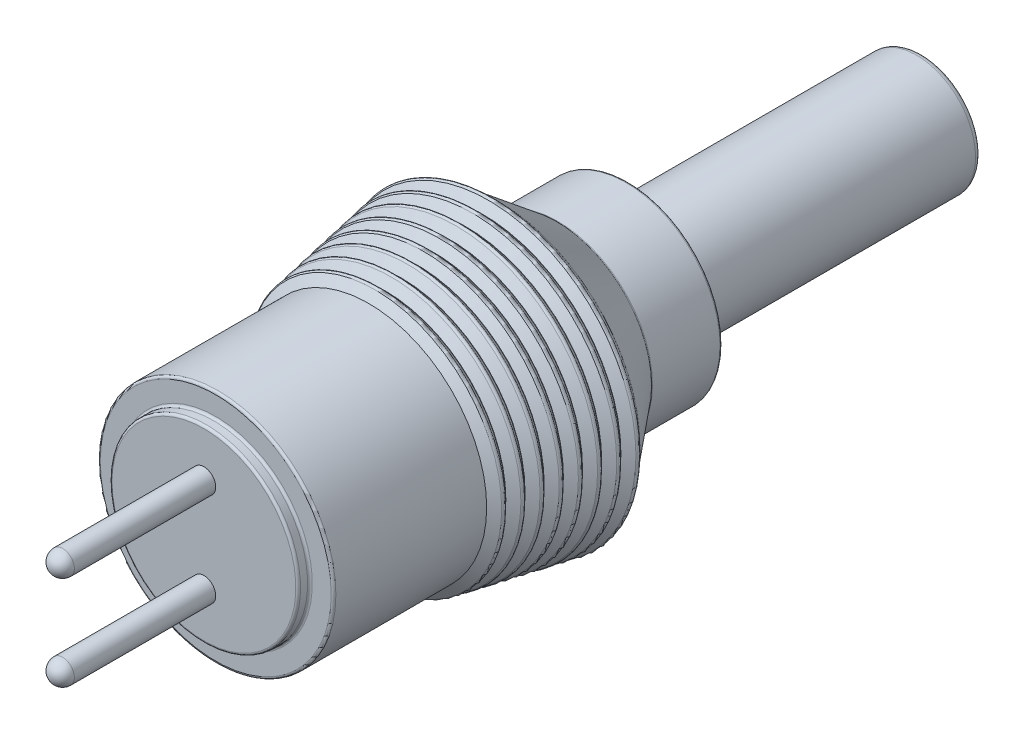
ISO-10303-21;
HEADER;
FILE_DESCRIPTION(('STEP AP214'),'2;1');
FILE_NAME('part.step','',(''),(''),'','','');
FILE_SCHEMA(('AUTOMOTIVE_DESIGN { 1 0 10303 214 1 1 1 1 }'));
ENDSEC;
DATA;
#1=APPLICATION_CONTEXT('core data for automotive mechanical design processes');
#2=APPLICATION_PROTOCOL_DEFINITION('international standard','automotive_design',2000,#1);
#3=PRODUCT_CONTEXT('',#1,'mechanical');
#4=PRODUCT('Part','Part','',(#3));
#5=PRODUCT_RELATED_PRODUCT_CATEGORY('part','',(#4));
#6=PRODUCT_DEFINITION_FORMATION('','',#4);
#7=PRODUCT_DEFINITION_CONTEXT('part definition',#1,'design');
#8=PRODUCT_DEFINITION('design','',#6,#7);
#9=PRODUCT_DEFINITION_SHAPE('','',#8);
#10=(LENGTH_UNIT() NAMED_UNIT(*) SI_UNIT(.MILLI.,.METRE.));
#11=(NAMED_UNIT(*) PLANE_ANGLE_UNIT() SI_UNIT($,.RADIAN.));
#12=(NAMED_UNIT(*) SI_UNIT($,.STERADIAN.) SOLID_ANGLE_UNIT());
#13=UNCERTAINTY_MEASURE_WITH_UNIT(LENGTH_MEASURE(1.E-05),#10,'distance_accuracy_value','');
#14=(GEOMETRIC_REPRESENTATION_CONTEXT(3) GLOBAL_UNCERTAINTY_ASSIGNED_CONTEXT((#13)) GLOBAL_UNIT_ASSIGNED_CONTEXT((#10,
#11,#12)) REPRESENTATION_CONTEXT('',''));
#15=CARTESIAN_POINT('',(0.,0.,0.));
#16=DIRECTION('',(0.,0.,1.));
#17=DIRECTION('',(1.,0.,0.));
#18=AXIS2_PLACEMENT_3D('',#15,#16,#17);
#19=CARTESIAN_POINT('',(0.,0.,15.25));
#20=DIRECTION('',(0.,0.,-1.));
#21=DIRECTION('',(-1.,0.,0.));
#22=AXIS2_PLACEMENT_3D('',#19,#20,#21);
#23=PLANE('',#22);
#24=CARTESIAN_POINT('',(0.,2.,15.25));
#25=DIRECTION('',(0.,0.,-1.));
#26=DIRECTION('',(-1.,0.,0.));
#27=AXIS2_PLACEMENT_3D('',#24,#25,#26);
#28=CIRCLE('',#27,0.5);
#29=CARTESIAN_POINT('',(-0.5,2.,15.25));
#30=VERTEX_POINT('',#29);
#31=EDGE_CURVE('E52',#30,#30,#28,.F.);
#32=ORIENTED_EDGE('',*,*,#31,.F.);
#33=EDGE_LOOP('',(#32));
#34=FACE_BOUND('',#33,.T.);
#35=CARTESIAN_POINT('',(0.,0.,15.25));
#36=DIRECTION('',(0.,0.,-1.));
#37=DIRECTION('',(-1.,0.,0.));
#38=AXIS2_PLACEMENT_3D('',#35,#36,#37);
#39=CIRCLE('',#38,3.9);
#40=CARTESIAN_POINT('',(-3.9,0.,15.25));
#41=VERTEX_POINT('',#40);
#42=EDGE_CURVE('E90',#41,#41,#39,.F.);
#43=ORIENTED_EDGE('',*,*,#42,.T.);
#44=EDGE_LOOP('',(#43));
#45=FACE_BOUND('',#44,.T.);
#46=CARTESIAN_POINT('',(0.,-2.,15.25));
#47=DIRECTION('',(0.,0.,-1.));
#48=DIRECTION('',(-1.,0.,0.));
#49=AXIS2_PLACEMENT_3D('',#46,#47,#48);
#50=CIRCLE('',#49,0.5);
#51=CARTESIAN_POINT('',(-0.5,-2.,15.25));
#52=VERTEX_POINT('',#51);
#53=EDGE_CURVE('E48',#52,#52,#50,.F.);
#54=ORIENTED_EDGE('',*,*,#53,.F.);
#55=EDGE_LOOP('',(#54));
#56=FACE_BOUND('',#55,.T.);
#57=ADVANCED_FACE('F37',(#34,#45,#56),#23,.F.);
#58=CARTESIAN_POINT('',(0.,0.,15.25));
#59=DIRECTION('',(0.,0.,1.));
#60=DIRECTION('',(1.,0.,0.));
#61=AXIS2_PLACEMENT_3D('',#58,#59,#60);
#62=CYLINDRICAL_SURFACE('',#61,4.);
#63=CARTESIAN_POINT('',(0.,0.,15.15));
#64=DIRECTION('',(0.,0.,-1.));
#65=DIRECTION('',(-1.,0.,0.));
#66=AXIS2_PLACEMENT_3D('',#63,#64,#65);
#67=CIRCLE('',#66,4.);
#68=CARTESIAN_POINT('',(-4.,0.,15.15));
#69=VERTEX_POINT('',#68);
#70=EDGE_CURVE('E84',#69,#69,#67,.T.);
#71=ORIENTED_EDGE('',*,*,#70,.T.);
#72=EDGE_LOOP('',(#71));
#73=FACE_BOUND('',#72,.T.);
#74=CARTESIAN_POINT('',(0.,0.,14.85));
#75=DIRECTION('',(0.,0.,-1.));
#76=DIRECTION('',(-1.,0.,0.));
#77=AXIS2_PLACEMENT_3D('',#74,#75,#76);
#78=CIRCLE('',#77,4.);
#79=CARTESIAN_POINT('',(-4.,0.,14.85));
#80=VERTEX_POINT('',#79);
#81=EDGE_CURVE('E87',#80,#80,#78,.F.);
#82=ORIENTED_EDGE('',*,*,#81,.T.);
#83=EDGE_LOOP('',(#82));
#84=FACE_BOUND('',#83,.T.);
#85=ADVANCED_FACE('F225',(#73,#84),#62,.T.);
#86=CARTESIAN_POINT('',(0.,4.,14.75));
#87=DIRECTION('',(0.,0.,-1.));
#88=DIRECTION('',(-1.,0.,0.));
#89=AXIS2_PLACEMENT_3D('',#86,#87,#88);
#90=PLANE('',#89);
#91=CARTESIAN_POINT('',(0.,0.,14.75));
#92=DIRECTION('',(0.,0.,-1.));
#93=DIRECTION('',(-1.,0.,0.));
#94=AXIS2_PLACEMENT_3D('',#91,#92,#93);
#95=CIRCLE('',#94,4.1);
#96=CARTESIAN_POINT('',(-4.1,0.,14.75));
#97=VERTEX_POINT('',#96);
#98=EDGE_CURVE('E78',#97,#97,#95,.T.);
#99=ORIENTED_EDGE('',*,*,#98,.T.);
#100=EDGE_LOOP('',(#99));
#101=FACE_BOUND('',#100,.T.);
#102=CARTESIAN_POINT('',(0.,0.,14.75));
#103=DIRECTION('',(0.,0.,-1.));
#104=DIRECTION('',(-1.,0.,0.));
#105=AXIS2_PLACEMENT_3D('',#102,#103,#104);
#106=CIRCLE('',#105,4.9);
#107=CARTESIAN_POINT('',(-4.9,0.,14.75));
#108=VERTEX_POINT('',#107);
#109=EDGE_CURVE('E81',#108,#108,#106,.F.);
#110=ORIENTED_EDGE('',*,*,#109,.T.);
#111=EDGE_LOOP('',(#110));
#112=FACE_BOUND('',#111,.T.);
#113=ADVANCED_FACE('F231',(#101,#112),#90,.F.);
#114=CARTESIAN_POINT('',(0.,0.,15.25));
#115=DIRECTION('',(0.,0.,1.));
#116=DIRECTION('',(1.,0.,0.));
#117=AXIS2_PLACEMENT_3D('',#114,#115,#116);
#118=CYLINDRICAL_SURFACE('',#117,5.);
#119=CARTESIAN_POINT('',(0.,0.,14.65));
#120=DIRECTION('',(0.,0.,-1.));
#121=DIRECTION('',(-1.,0.,0.));
#122=AXIS2_PLACEMENT_3D('',#119,#120,#121);
#123=CIRCLE('',#122,5.);
#124=CARTESIAN_POINT('',(-5.,0.,14.65));
#125=VERTEX_POINT('',#124);
#126=EDGE_CURVE('E75',#125,#125,#123,.T.);
#127=ORIENTED_EDGE('',*,*,#126,.T.);
#128=EDGE_LOOP('',(#127));
#129=FACE_BOUND('',#128,.T.);
#130=CARTESIAN_POINT('',(0.,0.,8.24999999999803));
#131=DIRECTION('',(0.,0.,1.));
#132=DIRECTION('',(1.,0.,0.));
#133=AXIS2_PLACEMENT_3D('',#130,#131,#132);
#134=CIRCLE('',#133,5.);
#135=CARTESIAN_POINT('',(5.,0.,8.24999999999803));
#136=VERTEX_POINT('',#135);
#137=EDGE_CURVE('E147',#136,#136,#134,.T.);
#138=ORIENTED_EDGE('',*,*,#137,.T.);
#139=EDGE_LOOP('',(#138));
#140=FACE_BOUND('',#139,.T.);
#141=ADVANCED_FACE('F471',(#129,#140),#118,.T.);
#142=CARTESIAN_POINT('',(0.,0.,7.92225975810284));
#143=DIRECTION('',(0.,0.,-1.));
#144=DIRECTION('',(-1.,0.,0.));
#145=AXIS2_PLACEMENT_3D('',#142,#143,#144);
#146=CONICAL_SURFACE('',#145,5.47892651278477,0.970669772638361);
#147=CARTESIAN_POINT('',(0.,0.,7.99093269234238));
#148=DIRECTION('',(0.,0.,1.));
#149=DIRECTION('',(1.,0.,0.));
#150=AXIS2_PLACEMENT_3D('',#147,#148,#149);
#151=CIRCLE('',#150,5.37857481740596);
#152=CARTESIAN_POINT('',(5.37857481740596,0.,7.99093269234238));
#153=VERTEX_POINT('',#152);
#154=EDGE_CURVE('E102',#153,#153,#151,.T.);
#155=ORIENTED_EDGE('',*,*,#154,.T.);
#156=EDGE_LOOP('',(#155));
#157=FACE_BOUND('',#156,.T.);
#158=ORIENTED_EDGE('',*,*,#137,.F.);
#159=EDGE_LOOP('',(#158));
#160=FACE_BOUND('',#159,.T.);
#161=ADVANCED_FACE('F477',(#157,#160),#146,.T.);
#162=CARTESIAN_POINT('',(0.,0.,7.5728400667517));
#163=DIRECTION('',(0.,0.,1.));
#164=DIRECTION('',(1.,0.,0.));
#165=AXIS2_PLACEMENT_3D('',#162,#163,#164);
#166=CONICAL_SURFACE('',#165,5.12311998786315,0.794454348232713);
#167=CARTESIAN_POINT('',(0.,0.,7.83705813859128));
#168=DIRECTION('',(0.,0.,-1.));
#169=DIRECTION('',(-1.,0.,0.));
#170=AXIS2_PLACEMENT_3D('',#167,#168,#169);
#171=CIRCLE('',#170,5.39216754382432);
#172=CARTESIAN_POINT('',(-5.39216754382432,0.,7.83705813859128));
#173=VERTEX_POINT('',#172);
#174=EDGE_CURVE('E99',#173,#173,#171,.T.);
#175=ORIENTED_EDGE('',*,*,#174,.T.);
#176=EDGE_LOOP('',(#175));
#177=FACE_BOUND('',#176,.T.);
#178=CARTESIAN_POINT('',(0.,0.,7.5728400667517));
#179=DIRECTION('',(0.,0.,1.));
#180=DIRECTION('',(1.,0.,0.));
#181=AXIS2_PLACEMENT_3D('',#178,#179,#180);
#182=CIRCLE('',#181,5.12311998786315);
#183=CARTESIAN_POINT('',(5.12311998786315,0.,7.5728400667517));
#184=VERTEX_POINT('',#183);
#185=EDGE_CURVE('E150',#184,#184,#182,.T.);
#186=ORIENTED_EDGE('',*,*,#185,.T.);
#187=EDGE_LOOP('',(#186));
#188=FACE_BOUND('',#187,.T.);
#189=ADVANCED_FACE('F699',(#177,#188),#166,.T.);
#190=CARTESIAN_POINT('',(0.,0.,7.56123343755917));
#191=DIRECTION('',(0.,0.,-1.));
#192=DIRECTION('',(-1.,0.,0.));
#193=AXIS2_PLACEMENT_3D('',#190,#191,#192);
#194=CONICAL_SURFACE('',#193,5.12523028407997,0.179853499792564);
#195=ORIENTED_EDGE('',*,*,#185,.F.);
#196=EDGE_LOOP('',(#195));
#197=FACE_BOUND('',#196,.T.);
#198=CARTESIAN_POINT('',(0.,0.,7.56123343755917));
#199=DIRECTION('',(0.,0.,1.));
#200=DIRECTION('',(1.,0.,0.));
#201=AXIS2_PLACEMENT_3D('',#198,#199,#200);
#202=CIRCLE('',#201,5.12523028407997);
#203=CARTESIAN_POINT('',(5.12523028407997,0.,7.56123343755917));
#204=VERTEX_POINT('',#203);
#205=EDGE_CURVE('E153',#204,#204,#202,.T.);
#206=ORIENTED_EDGE('',*,*,#205,.T.);
#207=EDGE_LOOP('',(#206));
#208=FACE_BOUND('',#207,.T.);
#209=ADVANCED_FACE('F692',(#197,#208),#194,.T.);
#210=CARTESIAN_POINT('',(0.,0.,7.23354023155084));
#211=DIRECTION('',(0.,0.,-1.));
#212=DIRECTION('',(-1.,0.,0.));
#213=AXIS2_PLACEMENT_3D('',#210,#211,#212);
#214=CONICAL_SURFACE('',#213,5.60408806336672,0.970669772638362);
#215=CARTESIAN_POINT('',(0.,0.,7.30221316579032));
#216=DIRECTION('',(0.,0.,1.));
#217=DIRECTION('',(1.,0.,0.));
#218=AXIS2_PLACEMENT_3D('',#215,#216,#217);
#219=CIRCLE('',#218,5.503736367988);
#220=CARTESIAN_POINT('',(5.503736367988,0.,7.30221316579032));
#221=VERTEX_POINT('',#220);
#222=EDGE_CURVE('E108',#221,#221,#219,.T.);
#223=ORIENTED_EDGE('',*,*,#222,.T.);
#224=EDGE_LOOP('',(#223));
#225=FACE_BOUND('',#224,.T.);
#226=ORIENTED_EDGE('',*,*,#205,.F.);
#227=EDGE_LOOP('',(#226));
#228=FACE_BOUND('',#227,.T.);
#229=ADVANCED_FACE('F682',(#225,#228),#214,.T.);
#230=CARTESIAN_POINT('',(0.,0.,6.88417068742834));
#231=DIRECTION('',(0.,0.,1.));
#232=DIRECTION('',(1.,0.,0.));
#233=AXIS2_PLACEMENT_3D('',#230,#231,#232);
#234=CONICAL_SURFACE('',#233,5.2483326022856,0.794454348231788);
#235=CARTESIAN_POINT('',(0.,0.,7.14833861203928));
#236=DIRECTION('',(0.,0.,-1.));
#237=DIRECTION('',(-1.,0.,0.));
#238=AXIS2_PLACEMENT_3D('',#235,#236,#237);
#239=CIRCLE('',#238,5.51732909440644);
#240=CARTESIAN_POINT('',(-5.51732909440644,0.,7.14833861203928));
#241=VERTEX_POINT('',#240);
#242=EDGE_CURVE('E105',#241,#241,#239,.T.);
#243=ORIENTED_EDGE('',*,*,#242,.T.);
#244=EDGE_LOOP('',(#243));
#245=FACE_BOUND('',#244,.T.);
#246=CARTESIAN_POINT('',(0.,0.,6.88417068742834));
#247=DIRECTION('',(0.,0.,1.));
#248=DIRECTION('',(1.,0.,0.));
#249=AXIS2_PLACEMENT_3D('',#246,#247,#248);
#250=CIRCLE('',#249,5.2483326022856);
#251=CARTESIAN_POINT('',(5.2483326022856,0.,6.88417068742834));
#252=VERTEX_POINT('',#251);
#253=EDGE_CURVE('E156',#252,#252,#250,.T.);
#254=ORIENTED_EDGE('',*,*,#253,.T.);
#255=EDGE_LOOP('',(#254));
#256=FACE_BOUND('',#255,.T.);
#257=ADVANCED_FACE('F676',(#245,#256),#234,.T.);
#258=CARTESIAN_POINT('',(0.,0.,6.87246687512044));
#259=DIRECTION('',(0.,0.,-1.));
#260=DIRECTION('',(-1.,0.,0.));
#261=AXIS2_PLACEMENT_3D('',#258,#259,#260);
#262=CONICAL_SURFACE('',#261,5.25046056815977,0.179853499792498);
#263=ORIENTED_EDGE('',*,*,#253,.F.);
#264=EDGE_LOOP('',(#263));
#265=FACE_BOUND('',#264,.T.);
#266=CARTESIAN_POINT('',(0.,0.,6.87246687512044));
#267=DIRECTION('',(0.,0.,1.));
#268=DIRECTION('',(1.,0.,0.));
#269=AXIS2_PLACEMENT_3D('',#266,#267,#268);
#270=CIRCLE('',#269,5.25046056815977);
#271=CARTESIAN_POINT('',(5.25046056815977,0.,6.87246687512044));
#272=VERTEX_POINT('',#271);
#273=EDGE_CURVE('E159',#272,#272,#270,.T.);
#274=ORIENTED_EDGE('',*,*,#273,.T.);
#275=EDGE_LOOP('',(#274));
#276=FACE_BOUND('',#275,.T.);
#277=ADVANCED_FACE('F669',(#265,#276),#262,.T.);
#278=CARTESIAN_POINT('',(0.,0.,6.54482070500005));
#279=DIRECTION('',(0.,0.,-1.));
#280=DIRECTION('',(-1.,0.,0.));
#281=AXIS2_PLACEMENT_3D('',#278,#279,#280);
#282=CONICAL_SURFACE('',#281,5.7292496139469,0.970669772638361);
#283=CARTESIAN_POINT('',(0.,0.,6.6134936392396));
#284=DIRECTION('',(0.,0.,1.));
#285=DIRECTION('',(1.,0.,0.));
#286=AXIS2_PLACEMENT_3D('',#283,#284,#285);
#287=CIRCLE('',#286,5.62889791856809);
#288=CARTESIAN_POINT('',(5.62889791856809,0.,6.6134936392396));
#289=VERTEX_POINT('',#288);
#290=EDGE_CURVE('E114',#289,#289,#287,.T.);
#291=ORIENTED_EDGE('',*,*,#290,.T.);
#292=EDGE_LOOP('',(#291));
#293=FACE_BOUND('',#292,.T.);
#294=ORIENTED_EDGE('',*,*,#273,.F.);
#295=EDGE_LOOP('',(#294));
#296=FACE_BOUND('',#295,.T.);
#297=ADVANCED_FACE('F659',(#293,#296),#282,.T.);
#298=CARTESIAN_POINT('',(0.,0.,6.19550130810859));
#299=DIRECTION('',(0.,0.,1.));
#300=DIRECTION('',(1.,0.,0.));
#301=AXIS2_PLACEMENT_3D('',#298,#299,#300);
#302=CONICAL_SURFACE('',#301,5.3735452167074,0.794454348232712);
#303=CARTESIAN_POINT('',(0.,0.,6.4596190854885));
#304=DIRECTION('',(0.,0.,-1.));
#305=DIRECTION('',(-1.,0.,0.));
#306=AXIS2_PLACEMENT_3D('',#303,#304,#305);
#307=CIRCLE('',#306,5.64249064498646);
#308=CARTESIAN_POINT('',(-5.64249064498646,0.,6.4596190854885));
#309=VERTEX_POINT('',#308);
#310=EDGE_CURVE('E111',#309,#309,#307,.T.);
#311=ORIENTED_EDGE('',*,*,#310,.T.);
#312=EDGE_LOOP('',(#311));
#313=FACE_BOUND('',#312,.T.);
#314=CARTESIAN_POINT('',(0.,0.,6.19550130810859));
#315=DIRECTION('',(0.,0.,1.));
#316=DIRECTION('',(1.,0.,0.));
#317=AXIS2_PLACEMENT_3D('',#314,#315,#316);
#318=CIRCLE('',#317,5.3735452167074);
#319=CARTESIAN_POINT('',(5.3735452167074,0.,6.19550130810859));
#320=VERTEX_POINT('',#319);
#321=EDGE_CURVE('E162',#320,#320,#318,.T.);
#322=ORIENTED_EDGE('',*,*,#321,.T.);
#323=EDGE_LOOP('',(#322));
#324=FACE_BOUND('',#323,.T.);
#325=ADVANCED_FACE('F653',(#313,#324),#302,.T.);
#326=CARTESIAN_POINT('',(0.,0.,6.18370031268171));
#327=DIRECTION('',(0.,0.,-1.));
#328=DIRECTION('',(-1.,0.,0.));
#329=AXIS2_PLACEMENT_3D('',#326,#327,#328);
#330=CONICAL_SURFACE('',#329,5.37569085223956,0.179853499792504);
#331=ORIENTED_EDGE('',*,*,#321,.F.);
#332=EDGE_LOOP('',(#331));
#333=FACE_BOUND('',#332,.T.);
#334=CARTESIAN_POINT('',(0.,0.,6.18370031268171));
#335=DIRECTION('',(0.,0.,1.));
#336=DIRECTION('',(1.,0.,0.));
#337=AXIS2_PLACEMENT_3D('',#334,#335,#336);
#338=CIRCLE('',#337,5.37569085223956);
#339=CARTESIAN_POINT('',(5.37569085223956,0.,6.18370031268171));
#340=VERTEX_POINT('',#339);
#341=EDGE_CURVE('E165',#340,#340,#338,.T.);
#342=ORIENTED_EDGE('',*,*,#341,.T.);
#343=EDGE_LOOP('',(#342));
#344=FACE_BOUND('',#343,.T.);
#345=ADVANCED_FACE('F646',(#333,#344),#330,.T.);
#346=CARTESIAN_POINT('',(0.,0.,5.85610117844866));
#347=DIRECTION('',(0.,0.,-1.));
#348=DIRECTION('',(-1.,0.,0.));
#349=AXIS2_PLACEMENT_3D('',#346,#347,#348);
#350=CONICAL_SURFACE('',#349,5.85441116452797,0.970669772638362);
#351=CARTESIAN_POINT('',(0.,0.,5.92477411268821));
#352=DIRECTION('',(0.,0.,1.));
#353=DIRECTION('',(1.,0.,0.));
#354=AXIS2_PLACEMENT_3D('',#351,#352,#353);
#355=CIRCLE('',#354,5.75405946914915);
#356=CARTESIAN_POINT('',(5.75405946914915,0.,5.92477411268821));
#357=VERTEX_POINT('',#356);
#358=EDGE_CURVE('E120',#357,#357,#355,.T.);
#359=ORIENTED_EDGE('',*,*,#358,.T.);
#360=EDGE_LOOP('',(#359));
#361=FACE_BOUND('',#360,.T.);
#362=ORIENTED_EDGE('',*,*,#341,.F.);
#363=EDGE_LOOP('',(#362));
#364=FACE_BOUND('',#363,.T.);
#365=ADVANCED_FACE('F636',(#361,#364),#350,.T.);
#366=CARTESIAN_POINT('',(0.,0.,5.50683192878704));
#367=DIRECTION('',(0.,0.,1.));
#368=DIRECTION('',(1.,0.,0.));
#369=AXIS2_PLACEMENT_3D('',#366,#367,#368);
#370=CONICAL_SURFACE('',#369,5.49875783112953,0.794454348232712);
#371=CARTESIAN_POINT('',(0.,0.,5.77089955893711));
#372=DIRECTION('',(0.,0.,-1.));
#373=DIRECTION('',(-1.,0.,0.));
#374=AXIS2_PLACEMENT_3D('',#371,#372,#373);
#375=CIRCLE('',#374,5.76765219556752);
#376=CARTESIAN_POINT('',(-5.76765219556752,0.,5.77089955893711));
#377=VERTEX_POINT('',#376);
#378=EDGE_CURVE('E117',#377,#377,#375,.T.);
#379=ORIENTED_EDGE('',*,*,#378,.T.);
#380=EDGE_LOOP('',(#379));
#381=FACE_BOUND('',#380,.T.);
#382=CARTESIAN_POINT('',(0.,0.,5.50683192878704));
#383=DIRECTION('',(0.,0.,1.));
#384=DIRECTION('',(1.,0.,0.));
#385=AXIS2_PLACEMENT_3D('',#382,#383,#384);
#386=CIRCLE('',#385,5.49875783112953);
#387=CARTESIAN_POINT('',(5.49875783112953,0.,5.50683192878704));
#388=VERTEX_POINT('',#387);
#389=EDGE_CURVE('E168',#388,#388,#386,.T.);
#390=ORIENTED_EDGE('',*,*,#389,.T.);
#391=EDGE_LOOP('',(#390));
#392=FACE_BOUND('',#391,.T.);
#393=ADVANCED_FACE('F630',(#381,#392),#370,.T.);
#394=CARTESIAN_POINT('',(0.,0.,5.49493375024298));
#395=DIRECTION('',(0.,0.,-1.));
#396=DIRECTION('',(-1.,0.,0.));
#397=AXIS2_PLACEMENT_3D('',#394,#395,#396);
#398=CONICAL_SURFACE('',#397,5.50092113631936,0.179853499792498);
#399=ORIENTED_EDGE('',*,*,#389,.F.);
#400=EDGE_LOOP('',(#399));
#401=FACE_BOUND('',#400,.T.);
#402=CARTESIAN_POINT('',(0.,0.,5.49493375024298));
#403=DIRECTION('',(0.,0.,1.));
#404=DIRECTION('',(1.,0.,0.));
#405=AXIS2_PLACEMENT_3D('',#402,#403,#404);
#406=CIRCLE('',#405,5.50092113631936);
#407=CARTESIAN_POINT('',(5.50092113631936,0.,5.49493375024298));
#408=VERTEX_POINT('',#407);
#409=EDGE_CURVE('E171',#408,#408,#406,.T.);
#410=ORIENTED_EDGE('',*,*,#409,.T.);
#411=EDGE_LOOP('',(#410));
#412=FACE_BOUND('',#411,.T.);
#413=ADVANCED_FACE('F623',(#401,#412),#398,.T.);
#414=CARTESIAN_POINT('',(0.,0.,5.16738165189727));
#415=DIRECTION('',(0.,0.,-1.));
#416=DIRECTION('',(-1.,0.,0.));
#417=AXIS2_PLACEMENT_3D('',#414,#415,#416);
#418=CONICAL_SURFACE('',#417,5.97957271510903,0.970669772638361);
#419=CARTESIAN_POINT('',(0.,0.,5.23605458613682));
#420=DIRECTION('',(0.,0.,1.));
#421=DIRECTION('',(1.,0.,0.));
#422=AXIS2_PLACEMENT_3D('',#419,#420,#421);
#423=CIRCLE('',#422,5.87922101973022);
#424=CARTESIAN_POINT('',(5.87922101973022,0.,5.23605458613682));
#425=VERTEX_POINT('',#424);
#426=EDGE_CURVE('E126',#425,#425,#423,.T.);
#427=ORIENTED_EDGE('',*,*,#426,.T.);
#428=EDGE_LOOP('',(#427));
#429=FACE_BOUND('',#428,.T.);
#430=ORIENTED_EDGE('',*,*,#409,.F.);
#431=EDGE_LOOP('',(#430));
#432=FACE_BOUND('',#431,.T.);
#433=ADVANCED_FACE('F613',(#429,#432),#418,.T.);
#434=CARTESIAN_POINT('',(0.,0.,4.81796196054614));
#435=DIRECTION('',(0.,0.,1.));
#436=DIRECTION('',(1.,0.,0.));
#437=AXIS2_PLACEMENT_3D('',#434,#435,#436);
#438=CONICAL_SURFACE('',#437,5.62376619018741,0.794454348232715);
#439=CARTESIAN_POINT('',(0.,0.,5.08218003238572));
#440=DIRECTION('',(0.,0.,-1.));
#441=DIRECTION('',(-1.,0.,0.));
#442=AXIS2_PLACEMENT_3D('',#439,#440,#441);
#443=CIRCLE('',#442,5.89281374614859);
#444=CARTESIAN_POINT('',(-5.89281374614859,0.,5.08218003238572));
#445=VERTEX_POINT('',#444);
#446=EDGE_CURVE('E123',#445,#445,#443,.T.);
#447=ORIENTED_EDGE('',*,*,#446,.T.);
#448=EDGE_LOOP('',(#447));
#449=FACE_BOUND('',#448,.T.);
#450=CARTESIAN_POINT('',(0.,0.,4.81796196054614));
#451=DIRECTION('',(0.,0.,1.));
#452=DIRECTION('',(1.,0.,0.));
#453=AXIS2_PLACEMENT_3D('',#450,#451,#452);
#454=CIRCLE('',#453,5.62376619018741);
#455=CARTESIAN_POINT('',(5.62376619018741,0.,4.81796196054614));
#456=VERTEX_POINT('',#455);
#457=EDGE_CURVE('E174',#456,#456,#454,.T.);
#458=ORIENTED_EDGE('',*,*,#457,.T.);
#459=EDGE_LOOP('',(#458));
#460=FACE_BOUND('',#459,.T.);
#461=ADVANCED_FACE('F607',(#449,#460),#438,.T.);
#462=CARTESIAN_POINT('',(0.,0.,4.80640236724107));
#463=DIRECTION('',(0.,0.,-1.));
#464=DIRECTION('',(-1.,0.,0.));
#465=AXIS2_PLACEMENT_3D('',#462,#463,#464);
#466=CONICAL_SURFACE('',#465,5.62580775290533,0.174809321957238);
#467=ORIENTED_EDGE('',*,*,#457,.F.);
#468=EDGE_LOOP('',(#467));
#469=FACE_BOUND('',#468,.T.);
#470=CARTESIAN_POINT('',(0.,0.,4.80640236724107));
#471=DIRECTION('',(0.,0.,1.));
#472=DIRECTION('',(1.,0.,0.));
#473=AXIS2_PLACEMENT_3D('',#470,#471,#472);
#474=CIRCLE('',#473,5.62580775290533);
#475=CARTESIAN_POINT('',(5.62580775290533,0.,4.80640236724107));
#476=VERTEX_POINT('',#475);
#477=EDGE_CURVE('E177',#476,#476,#474,.T.);
#478=ORIENTED_EDGE('',*,*,#477,.T.);
#479=EDGE_LOOP('',(#478));
#480=FACE_BOUND('',#479,.T.);
#481=ADVANCED_FACE('F600',(#469,#480),#466,.T.);
#482=CARTESIAN_POINT('',(0.,0.,4.47866212534588));
#483=DIRECTION('',(0.,0.,-1.));
#484=DIRECTION('',(-1.,0.,0.));
#485=AXIS2_PLACEMENT_3D('',#482,#483,#484);
#486=CONICAL_SURFACE('',#485,6.1047342656901,0.970669772638361);
#487=CARTESIAN_POINT('',(0.,0.,4.54733505958543));
#488=DIRECTION('',(0.,0.,1.));
#489=DIRECTION('',(1.,0.,0.));
#490=AXIS2_PLACEMENT_3D('',#487,#488,#489);
#491=CIRCLE('',#490,6.00438257031128);
#492=CARTESIAN_POINT('',(6.00438257031128,0.,4.54733505958543));
#493=VERTEX_POINT('',#492);
#494=EDGE_CURVE('E132',#493,#493,#491,.T.);
#495=ORIENTED_EDGE('',*,*,#494,.T.);
#496=EDGE_LOOP('',(#495));
#497=FACE_BOUND('',#496,.T.);
#498=ORIENTED_EDGE('',*,*,#477,.F.);
#499=EDGE_LOOP('',(#498));
#500=FACE_BOUND('',#499,.T.);
#501=ADVANCED_FACE('F590',(#497,#500),#486,.T.);
#502=CARTESIAN_POINT('',(0.,0.,4.12949317014393));
#503=DIRECTION('',(0.,0.,1.));
#504=DIRECTION('',(1.,0.,0.));
#505=AXIS2_PLACEMENT_3D('',#502,#503,#504);
#506=CONICAL_SURFACE('',#505,5.74918305997378,0.794454348232714);
#507=CARTESIAN_POINT('',(0.,0.,4.39346050583433));
#508=DIRECTION('',(0.,0.,-1.));
#509=DIRECTION('',(-1.,0.,0.));
#510=AXIS2_PLACEMENT_3D('',#507,#508,#509);
#511=CIRCLE('',#510,6.01797529672965);
#512=CARTESIAN_POINT('',(-6.01797529672965,0.,4.39346050583433));
#513=VERTEX_POINT('',#512);
#514=EDGE_CURVE('E129',#513,#513,#511,.T.);
#515=ORIENTED_EDGE('',*,*,#514,.T.);
#516=EDGE_LOOP('',(#515));
#517=FACE_BOUND('',#516,.T.);
#518=CARTESIAN_POINT('',(0.,0.,4.12949317014393));
#519=DIRECTION('',(0.,0.,1.));
#520=DIRECTION('',(1.,0.,0.));
#521=AXIS2_PLACEMENT_3D('',#518,#519,#520);
#522=CIRCLE('',#521,5.74918305997378);
#523=CARTESIAN_POINT('',(5.74918305997378,0.,4.12949317014393));
#524=VERTEX_POINT('',#523);
#525=EDGE_CURVE('E180',#524,#524,#522,.T.);
#526=ORIENTED_EDGE('',*,*,#525,.T.);
#527=EDGE_LOOP('',(#526));
#528=FACE_BOUND('',#527,.T.);
#529=ADVANCED_FACE('F584',(#517,#528),#506,.T.);
#530=CARTESIAN_POINT('',(0.,0.,4.11740062536552));
#531=DIRECTION('',(0.,0.,-1.));
#532=DIRECTION('',(-1.,0.,0.));
#533=AXIS2_PLACEMENT_3D('',#530,#531,#532);
#534=CONICAL_SURFACE('',#533,5.75138170447895,0.179853499792485);
#535=ORIENTED_EDGE('',*,*,#525,.F.);
#536=EDGE_LOOP('',(#535));
#537=FACE_BOUND('',#536,.T.);
#538=CARTESIAN_POINT('',(0.,0.,4.11740062536552));
#539=DIRECTION('',(0.,0.,1.));
#540=DIRECTION('',(1.,0.,0.));
#541=AXIS2_PLACEMENT_3D('',#538,#539,#540);
#542=CIRCLE('',#541,5.75138170447895);
#543=CARTESIAN_POINT('',(5.75138170447895,0.,4.11740062536552));
#544=VERTEX_POINT('',#543);
#545=EDGE_CURVE('E183',#544,#544,#542,.T.);
#546=ORIENTED_EDGE('',*,*,#545,.T.);
#547=EDGE_LOOP('',(#546));
#548=FACE_BOUND('',#547,.T.);
#549=ADVANCED_FACE('F577',(#537,#548),#534,.T.);
#550=CARTESIAN_POINT('',(0.,0.,3.78994259879449));
#551=DIRECTION('',(0.,0.,-1.));
#552=DIRECTION('',(-1.,0.,0.));
#553=AXIS2_PLACEMENT_3D('',#550,#551,#552);
#554=CONICAL_SURFACE('',#553,6.22989581627116,0.970669772638361);
#555=CARTESIAN_POINT('',(0.,0.,3.85861553303404));
#556=DIRECTION('',(0.,0.,1.));
#557=DIRECTION('',(1.,0.,0.));
#558=AXIS2_PLACEMENT_3D('',#555,#556,#557);
#559=CIRCLE('',#558,6.12954412089235);
#560=CARTESIAN_POINT('',(6.12954412089235,0.,3.85861553303404));
#561=VERTEX_POINT('',#560);
#562=EDGE_CURVE('E138',#561,#561,#559,.T.);
#563=ORIENTED_EDGE('',*,*,#562,.T.);
#564=EDGE_LOOP('',(#563));
#565=FACE_BOUND('',#564,.T.);
#566=ORIENTED_EDGE('',*,*,#545,.F.);
#567=EDGE_LOOP('',(#566));
#568=FACE_BOUND('',#567,.T.);
#569=ADVANCED_FACE('F567',(#565,#568),#554,.T.);
#570=CARTESIAN_POINT('',(0.,0.,3.44082379082237));
#571=DIRECTION('',(0.,0.,1.));
#572=DIRECTION('',(1.,0.,0.));
#573=AXIS2_PLACEMENT_3D('',#570,#571,#572);
#574=CONICAL_SURFACE('',#573,5.87439567439591,0.794454348232712);
#575=CARTESIAN_POINT('',(0.,0.,3.70474097928293));
#576=DIRECTION('',(0.,0.,-1.));
#577=DIRECTION('',(-1.,0.,0.));
#578=AXIS2_PLACEMENT_3D('',#575,#576,#577);
#579=CIRCLE('',#578,6.14313684731072);
#580=CARTESIAN_POINT('',(-6.14313684731072,0.,3.70474097928293));
#581=VERTEX_POINT('',#580);
#582=EDGE_CURVE('E135',#581,#581,#579,.T.);
#583=ORIENTED_EDGE('',*,*,#582,.T.);
#584=EDGE_LOOP('',(#583));
#585=FACE_BOUND('',#584,.T.);
#586=CARTESIAN_POINT('',(0.,0.,3.44082379082237));
#587=DIRECTION('',(0.,0.,1.));
#588=DIRECTION('',(1.,0.,0.));
#589=AXIS2_PLACEMENT_3D('',#586,#587,#588);
#590=CIRCLE('',#589,5.87439567439591);
#591=CARTESIAN_POINT('',(5.87439567439591,0.,3.44082379082237));
#592=VERTEX_POINT('',#591);
#593=EDGE_CURVE('E186',#592,#592,#590,.T.);
#594=ORIENTED_EDGE('',*,*,#593,.T.);
#595=EDGE_LOOP('',(#594));
#596=FACE_BOUND('',#595,.T.);
#597=ADVANCED_FACE('F561',(#585,#596),#574,.T.);
#598=CARTESIAN_POINT('',(0.,0.,3.42863406292679));
#599=DIRECTION('',(0.,0.,-1.));
#600=DIRECTION('',(-1.,0.,0.));
#601=AXIS2_PLACEMENT_3D('',#598,#599,#600);
#602=CONICAL_SURFACE('',#601,5.87661198855874,0.179853499792478);
#603=ORIENTED_EDGE('',*,*,#593,.F.);
#604=EDGE_LOOP('',(#603));
#605=FACE_BOUND('',#604,.T.);
#606=CARTESIAN_POINT('',(0.,0.,3.42863406292679));
#607=DIRECTION('',(0.,0.,1.));
#608=DIRECTION('',(1.,0.,0.));
#609=AXIS2_PLACEMENT_3D('',#606,#607,#608);
#610=CIRCLE('',#609,5.87661198855874);
#611=CARTESIAN_POINT('',(5.87661198855874,0.,3.42863406292679));
#612=VERTEX_POINT('',#611);
#613=EDGE_CURVE('E189',#612,#612,#610,.T.);
#614=ORIENTED_EDGE('',*,*,#613,.T.);
#615=EDGE_LOOP('',(#614));
#616=FACE_BOUND('',#615,.T.);
#617=ADVANCED_FACE('F554',(#605,#616),#602,.T.);
#618=CARTESIAN_POINT('',(0.,0.,3.1012230722431));
#619=DIRECTION('',(0.,0.,-1.));
#620=DIRECTION('',(-1.,0.,0.));
#621=AXIS2_PLACEMENT_3D('',#618,#619,#620);
#622=CONICAL_SURFACE('',#621,6.35505736685223,0.970669772638359);
#623=CARTESIAN_POINT('',(0.,0.,3.16989600648265));
#624=DIRECTION('',(0.,0.,1.));
#625=DIRECTION('',(1.,0.,0.));
#626=AXIS2_PLACEMENT_3D('',#623,#624,#625);
#627=CIRCLE('',#626,6.25470567147342);
#628=CARTESIAN_POINT('',(6.25470567147342,0.,3.16989600648265));
#629=VERTEX_POINT('',#628);
#630=EDGE_CURVE('E144',#629,#629,#627,.T.);
#631=ORIENTED_EDGE('',*,*,#630,.T.);
#632=EDGE_LOOP('',(#631));
#633=FACE_BOUND('',#632,.T.);
#634=ORIENTED_EDGE('',*,*,#613,.F.);
#635=EDGE_LOOP('',(#634));
#636=FACE_BOUND('',#635,.T.);
#637=ADVANCED_FACE('F544',(#633,#636),#622,.T.);
#638=CARTESIAN_POINT('',(0.,0.,2.75215441150082));
#639=DIRECTION('',(0.,0.,1.));
#640=DIRECTION('',(1.,0.,0.));
#641=AXIS2_PLACEMENT_3D('',#638,#639,#640);
#642=CONICAL_SURFACE('',#641,5.99960828881803,0.794454348232713);
#643=CARTESIAN_POINT('',(0.,0.,3.01602145273154));
#644=DIRECTION('',(0.,0.,-1.));
#645=DIRECTION('',(-1.,0.,0.));
#646=AXIS2_PLACEMENT_3D('',#643,#644,#645);
#647=CIRCLE('',#646,6.26829839789179);
#648=CARTESIAN_POINT('',(-6.26829839789179,0.,3.01602145273154));
#649=VERTEX_POINT('',#648);
#650=EDGE_CURVE('E141',#649,#649,#647,.T.);
#651=ORIENTED_EDGE('',*,*,#650,.T.);
#652=EDGE_LOOP('',(#651));
#653=FACE_BOUND('',#652,.T.);
#654=CARTESIAN_POINT('',(0.,0.,2.75215441150082));
#655=DIRECTION('',(0.,0.,1.));
#656=DIRECTION('',(1.,0.,0.));
#657=AXIS2_PLACEMENT_3D('',#654,#655,#656);
#658=CIRCLE('',#657,5.99960828881803);
#659=CARTESIAN_POINT('',(5.99960828881803,0.,2.75215441150082));
#660=VERTEX_POINT('',#659);
#661=EDGE_CURVE('E192',#660,#660,#658,.T.);
#662=ORIENTED_EDGE('',*,*,#661,.T.);
#663=EDGE_LOOP('',(#662));
#664=FACE_BOUND('',#663,.T.);
#665=ADVANCED_FACE('F538',(#653,#664),#642,.T.);
#666=CARTESIAN_POINT('',(0.,0.,2.75));
#667=DIRECTION('',(0.,0.,-1.));
#668=DIRECTION('',(-1.,0.,0.));
#669=AXIS2_PLACEMENT_3D('',#666,#667,#668);
#670=CONICAL_SURFACE('',#669,6.,0.179853499792443);
#671=ORIENTED_EDGE('',*,*,#661,.F.);
#672=EDGE_LOOP('',(#671));
#673=FACE_BOUND('',#672,.T.);
#674=CARTESIAN_POINT('',(0.,0.,2.75));
#675=DIRECTION('',(0.,0.,1.));
#676=DIRECTION('',(1.,0.,0.));
#677=AXIS2_PLACEMENT_3D('',#674,#675,#676);
#678=CIRCLE('',#677,6.);
#679=CARTESIAN_POINT('',(6.,0.,2.75));
#680=VERTEX_POINT('',#679);
#681=EDGE_CURVE('E195',#680,#680,#678,.T.);
#682=ORIENTED_EDGE('',*,*,#681,.T.);
#683=EDGE_LOOP('',(#682));
#684=FACE_BOUND('',#683,.T.);
#685=ADVANCED_FACE('F464',(#673,#684),#670,.T.);
#686=CARTESIAN_POINT('',(0.,0.,0.250000000000002));
#687=DIRECTION('',(0.,0.,1.));
#688=DIRECTION('',(1.,0.,0.));
#689=AXIS2_PLACEMENT_3D('',#686,#687,#688);
#690=CONICAL_SURFACE('',#689,4.,0.674740942223553);
#691=CARTESIAN_POINT('',(0.,0.,0.277391398819623));
#692=DIRECTION('',(0.,0.,1.));
#693=DIRECTION('',(1.,0.,0.));
#694=AXIS2_PLACEMENT_3D('',#691,#692,#693);
#695=CIRCLE('',#694,4.0219131190557);
#696=CARTESIAN_POINT('',(4.0219131190557,0.,0.277391398819623));
#697=VERTEX_POINT('',#696);
#698=EDGE_CURVE('E72',#697,#697,#695,.T.);
#699=ORIENTED_EDGE('',*,*,#698,.T.);
#700=EDGE_LOOP('',(#699));
#701=FACE_BOUND('',#700,.T.);
#702=ORIENTED_EDGE('',*,*,#681,.F.);
#703=EDGE_LOOP('',(#702));
#704=FACE_BOUND('',#703,.T.);
#705=ADVANCED_FACE('F454',(#701,#704),#690,.T.);
#706=CARTESIAN_POINT('',(0.,0.,15.25));
#707=DIRECTION('',(0.,0.,1.));
#708=DIRECTION('',(1.,0.,0.));
#709=AXIS2_PLACEMENT_3D('',#706,#707,#708);
#710=CYLINDRICAL_SURFACE('',#709,4.);
#711=CARTESIAN_POINT('',(0.,0.,0.21492189406418));
#712=DIRECTION('',(0.,0.,1.));
#713=DIRECTION('',(1.,0.,0.));
#714=AXIS2_PLACEMENT_3D('',#711,#712,#713);
#715=CIRCLE('',#714,4.);
#716=CARTESIAN_POINT('',(4.,0.,0.21492189406418));
#717=VERTEX_POINT('',#716);
#718=EDGE_CURVE('E66',#717,#717,#715,.F.);
#719=ORIENTED_EDGE('',*,*,#718,.T.);
#720=EDGE_LOOP('',(#719));
#721=FACE_BOUND('',#720,.T.);
#722=CARTESIAN_POINT('',(0.,0.,-2.65));
#723=DIRECTION('',(0.,0.,1.));
#724=DIRECTION('',(1.,0.,0.));
#725=AXIS2_PLACEMENT_3D('',#722,#723,#724);
#726=CIRCLE('',#725,4.);
#727=CARTESIAN_POINT('',(4.,0.,-2.65));
#728=VERTEX_POINT('',#727);
#729=EDGE_CURVE('E69',#728,#728,#726,.T.);
#730=ORIENTED_EDGE('',*,*,#729,.T.);
#731=EDGE_LOOP('',(#730));
#732=FACE_BOUND('',#731,.T.);
#733=ADVANCED_FACE('F444',(#721,#732),#710,.T.);
#734=CARTESIAN_POINT('',(0.,4.,-2.75));
#735=DIRECTION('',(0.,0.,1.));
#736=DIRECTION('',(1.,0.,0.));
#737=AXIS2_PLACEMENT_3D('',#734,#735,#736);
#738=PLANE('',#737);
#739=CARTESIAN_POINT('',(0.,0.,-2.75));
#740=DIRECTION('',(0.,0.,1.));
#741=DIRECTION('',(1.,0.,0.));
#742=AXIS2_PLACEMENT_3D('',#739,#740,#741);
#743=CIRCLE('',#742,2.6);
#744=CARTESIAN_POINT('',(2.6,0.,-2.75));
#745=VERTEX_POINT('',#744);
#746=EDGE_CURVE('E60',#745,#745,#743,.T.);
#747=ORIENTED_EDGE('',*,*,#746,.T.);
#748=EDGE_LOOP('',(#747));
#749=FACE_BOUND('',#748,.T.);
#750=CARTESIAN_POINT('',(0.,0.,-2.75));
#751=DIRECTION('',(0.,0.,1.));
#752=DIRECTION('',(1.,0.,0.));
#753=AXIS2_PLACEMENT_3D('',#750,#751,#752);
#754=CIRCLE('',#753,3.9);
#755=CARTESIAN_POINT('',(3.9,0.,-2.75));
#756=VERTEX_POINT('',#755);
#757=EDGE_CURVE('E63',#756,#756,#754,.F.);
#758=ORIENTED_EDGE('',*,*,#757,.T.);
#759=EDGE_LOOP('',(#758));
#760=FACE_BOUND('',#759,.T.);
#761=ADVANCED_FACE('F221',(#749,#760),#738,.F.);
#762=CARTESIAN_POINT('',(0.,0.,15.25));
#763=DIRECTION('',(0.,0.,1.));
#764=DIRECTION('',(1.,0.,0.));
#765=AXIS2_PLACEMENT_3D('',#762,#763,#764);
#766=CYLINDRICAL_SURFACE('',#765,2.5);
#767=CARTESIAN_POINT('',(0.,0.,-2.85));
#768=DIRECTION('',(0.,0.,1.));
#769=DIRECTION('',(1.,0.,0.));
#770=AXIS2_PLACEMENT_3D('',#767,#768,#769);
#771=CIRCLE('',#770,2.5);
#772=CARTESIAN_POINT('',(2.5,0.,-2.85));
#773=VERTEX_POINT('',#772);
#774=EDGE_CURVE('E57',#773,#773,#771,.F.);
#775=ORIENTED_EDGE('',*,*,#774,.T.);
#776=EDGE_LOOP('',(#775));
#777=FACE_BOUND('',#776,.T.);
#778=CARTESIAN_POINT('',(0.,0.,-15.));
#779=DIRECTION('',(0.,0.,1.));
#780=DIRECTION('',(1.,0.,0.));
#781=AXIS2_PLACEMENT_3D('',#778,#779,#780);
#782=CIRCLE('',#781,2.5);
#783=CARTESIAN_POINT('',(2.5,0.,-15.));
#784=VERTEX_POINT('',#783);
#785=EDGE_CURVE('E96',#784,#784,#782,.T.);
#786=ORIENTED_EDGE('',*,*,#785,.T.);
#787=EDGE_LOOP('',(#786));
#788=FACE_BOUND('',#787,.T.);
#789=ADVANCED_FACE('F215',(#777,#788),#766,.T.);
#790=CARTESIAN_POINT('',(0.,2.5,-15.25));
#791=DIRECTION('',(0.,0.,1.));
#792=DIRECTION('',(1.,0.,0.));
#793=AXIS2_PLACEMENT_3D('',#790,#791,#792);
#794=PLANE('',#793);
#795=CARTESIAN_POINT('',(0.,0.,-15.25));
#796=DIRECTION('',(0.,0.,1.));
#797=DIRECTION('',(1.,0.,0.));
#798=AXIS2_PLACEMENT_3D('',#795,#796,#797);
#799=CIRCLE('',#798,2.25);
#800=CARTESIAN_POINT('',(2.25,0.,-15.25));
#801=VERTEX_POINT('',#800);
#802=EDGE_CURVE('E93',#801,#801,#799,.F.);
#803=ORIENTED_EDGE('',*,*,#802,.T.);
#804=EDGE_LOOP('',(#803));
#805=FACE_BOUND('',#804,.T.);
#806=CARTESIAN_POINT('',(0.,0.,-15.25));
#807=DIRECTION('',(0.,0.,-1.));
#808=DIRECTION('',(-1.,0.,0.));
#809=AXIS2_PLACEMENT_3D('',#806,#807,#808);
#810=CIRCLE('',#809,1.75);
#811=CARTESIAN_POINT('',(-1.75,0.,-15.25));
#812=VERTEX_POINT('',#811);
#813=EDGE_CURVE('E199',#812,#812,#810,.T.);
#814=ORIENTED_EDGE('',*,*,#813,.F.);
#815=EDGE_LOOP('',(#814));
#816=FACE_BOUND('',#815,.T.);
#817=ADVANCED_FACE('F210',(#805,#816),#794,.F.);
#818=CARTESIAN_POINT('',(0.,0.,-3.25));
#819=DIRECTION('',(0.,0.,-1.));
#820=DIRECTION('',(-1.,0.,0.));
#821=AXIS2_PLACEMENT_3D('',#818,#819,#820);
#822=CYLINDRICAL_SURFACE('',#821,1.75);
#823=CARTESIAN_POINT('',(0.,0.,-3.25));
#824=DIRECTION('',(0.,0.,-1.));
#825=DIRECTION('',(-1.,0.,0.));
#826=AXIS2_PLACEMENT_3D('',#823,#824,#825);
#827=CIRCLE('',#826,1.75);
#828=CARTESIAN_POINT('',(-1.75,0.,-3.25));
#829=VERTEX_POINT('',#828);
#830=EDGE_CURVE('E198',#829,#829,#827,.T.);
#831=ORIENTED_EDGE('',*,*,#830,.F.);
#832=EDGE_LOOP('',(#831));
#833=FACE_BOUND('',#832,.T.);
#834=ORIENTED_EDGE('',*,*,#813,.T.);
#835=EDGE_LOOP('',(#834));
#836=FACE_BOUND('',#835,.T.);
#837=ADVANCED_FACE('F207',(#833,#836),#822,.F.);
#838=CARTESIAN_POINT('',(0.,0.,-3.25));
#839=DIRECTION('',(0.,0.,-1.));
#840=DIRECTION('',(-1.,0.,0.));
#841=AXIS2_PLACEMENT_3D('',#838,#839,#840);
#842=PLANE('',#841);
#843=ORIENTED_EDGE('',*,*,#830,.T.);
#844=EDGE_LOOP('',(#843));
#845=FACE_BOUND('',#844,.T.);
#846=ADVANCED_FACE('F205',(#845),#842,.T.);
#847=CARTESIAN_POINT('',(0.,0.,3.08736959143779));
#848=DIRECTION('',(0.,0.,-1.));
#849=DIRECTION('',(-1.,0.,0.));
#850=AXIS2_PLACEMENT_3D('',#847,#848,#849);
#851=TOROIDAL_SURFACE('',#850,6.19823097962084,0.1);
#852=ORIENTED_EDGE('',*,*,#650,.F.);
#853=EDGE_LOOP('',(#852));
#854=FACE_BOUND('',#853,.T.);
#855=ORIENTED_EDGE('',*,*,#630,.F.);
#856=EDGE_LOOP('',(#855));
#857=FACE_BOUND('',#856,.T.);
#858=ADVANCED_FACE('F238',(#854,#857),#851,.T.);
#859=CARTESIAN_POINT('',(0.,0.,3.77608911798918));
#860=DIRECTION('',(0.,0.,-1.));
#861=DIRECTION('',(-1.,0.,0.));
#862=AXIS2_PLACEMENT_3D('',#859,#860,#861);
#863=TOROIDAL_SURFACE('',#862,6.07306942903978,0.1);
#864=ORIENTED_EDGE('',*,*,#582,.F.);
#865=EDGE_LOOP('',(#864));
#866=FACE_BOUND('',#865,.T.);
#867=ORIENTED_EDGE('',*,*,#562,.F.);
#868=EDGE_LOOP('',(#867));
#869=FACE_BOUND('',#868,.T.);
#870=ADVANCED_FACE('F241',(#866,#869),#863,.T.);
#871=CARTESIAN_POINT('',(0.,0.,4.46480864454057));
#872=DIRECTION('',(0.,0.,-1.));
#873=DIRECTION('',(-1.,0.,0.));
#874=AXIS2_PLACEMENT_3D('',#871,#872,#873);
#875=TOROIDAL_SURFACE('',#874,5.94790787845871,0.1);
#876=ORIENTED_EDGE('',*,*,#514,.F.);
#877=EDGE_LOOP('',(#876));
#878=FACE_BOUND('',#877,.T.);
#879=ORIENTED_EDGE('',*,*,#494,.F.);
#880=EDGE_LOOP('',(#879));
#881=FACE_BOUND('',#880,.T.);
#882=ADVANCED_FACE('F245',(#878,#881),#875,.T.);
#883=CARTESIAN_POINT('',(0.,0.,5.15352817109196));
#884=DIRECTION('',(0.,0.,-1.));
#885=DIRECTION('',(-1.,0.,0.));
#886=AXIS2_PLACEMENT_3D('',#883,#884,#885);
#887=TOROIDAL_SURFACE('',#886,5.82274632787765,0.1);
#888=ORIENTED_EDGE('',*,*,#446,.F.);
#889=EDGE_LOOP('',(#888));
#890=FACE_BOUND('',#889,.T.);
#891=ORIENTED_EDGE('',*,*,#426,.F.);
#892=EDGE_LOOP('',(#891));
#893=FACE_BOUND('',#892,.T.);
#894=ADVANCED_FACE('F249',(#890,#893),#887,.T.);
#895=CARTESIAN_POINT('',(0.,0.,5.84224769764335));
#896=DIRECTION('',(0.,0.,-1.));
#897=DIRECTION('',(-1.,0.,0.));
#898=AXIS2_PLACEMENT_3D('',#895,#896,#897);
#899=TOROIDAL_SURFACE('',#898,5.69758477729658,0.1);
#900=ORIENTED_EDGE('',*,*,#378,.F.);
#901=EDGE_LOOP('',(#900));
#902=FACE_BOUND('',#901,.T.);
#903=ORIENTED_EDGE('',*,*,#358,.F.);
#904=EDGE_LOOP('',(#903));
#905=FACE_BOUND('',#904,.T.);
#906=ADVANCED_FACE('F253',(#902,#905),#899,.T.);
#907=CARTESIAN_POINT('',(0.,0.,6.53096722419474));
#908=DIRECTION('',(0.,0.,-1.));
#909=DIRECTION('',(-1.,0.,0.));
#910=AXIS2_PLACEMENT_3D('',#907,#908,#909);
#911=TOROIDAL_SURFACE('',#910,5.57242322671552,0.1);
#912=ORIENTED_EDGE('',*,*,#310,.F.);
#913=EDGE_LOOP('',(#912));
#914=FACE_BOUND('',#913,.T.);
#915=ORIENTED_EDGE('',*,*,#290,.F.);
#916=EDGE_LOOP('',(#915));
#917=FACE_BOUND('',#916,.T.);
#918=ADVANCED_FACE('F257',(#914,#917),#911,.T.);
#919=CARTESIAN_POINT('',(0.,0.,7.21968675074546));
#920=DIRECTION('',(0.,0.,-1.));
#921=DIRECTION('',(-1.,0.,0.));
#922=AXIS2_PLACEMENT_3D('',#919,#920,#921);
#923=TOROIDAL_SURFACE('',#922,5.44726167613543,0.1);
#924=ORIENTED_EDGE('',*,*,#242,.F.);
#925=EDGE_LOOP('',(#924));
#926=FACE_BOUND('',#925,.T.);
#927=ORIENTED_EDGE('',*,*,#222,.F.);
#928=EDGE_LOOP('',(#927));
#929=FACE_BOUND('',#928,.T.);
#930=ADVANCED_FACE('F261',(#926,#929),#923,.T.);
#931=CARTESIAN_POINT('',(0.,0.,7.90840627729752));
#932=DIRECTION('',(0.,0.,-1.));
#933=DIRECTION('',(-1.,0.,0.));
#934=AXIS2_PLACEMENT_3D('',#931,#932,#933);
#935=TOROIDAL_SURFACE('',#934,5.32210012555339,0.1);
#936=ORIENTED_EDGE('',*,*,#174,.F.);
#937=EDGE_LOOP('',(#936));
#938=FACE_BOUND('',#937,.T.);
#939=ORIENTED_EDGE('',*,*,#154,.F.);
#940=EDGE_LOOP('',(#939));
#941=FACE_BOUND('',#940,.T.);
#942=ADVANCED_FACE('F265',(#938,#941),#935,.T.);
#943=CARTESIAN_POINT('',(0.,0.,-15.));
#944=DIRECTION('',(0.,0.,1.));
#945=DIRECTION('',(1.,0.,0.));
#946=AXIS2_PLACEMENT_3D('',#943,#944,#945);
#947=TOROIDAL_SURFACE('',#946,2.25,0.25);
#948=ORIENTED_EDGE('',*,*,#802,.F.);
#949=EDGE_LOOP('',(#948));
#950=FACE_BOUND('',#949,.T.);
#951=ORIENTED_EDGE('',*,*,#785,.F.);
#952=EDGE_LOOP('',(#951));
#953=FACE_BOUND('',#952,.T.);
#954=ADVANCED_FACE('F269',(#950,#953),#947,.T.);
#955=CARTESIAN_POINT('',(0.,0.,15.15));
#956=DIRECTION('',(0.,0.,-1.));
#957=DIRECTION('',(-1.,0.,0.));
#958=AXIS2_PLACEMENT_3D('',#955,#956,#957);
#959=TOROIDAL_SURFACE('',#958,3.9,0.1);
#960=ORIENTED_EDGE('',*,*,#70,.F.);
#961=EDGE_LOOP('',(#960));
#962=FACE_BOUND('',#961,.T.);
#963=ORIENTED_EDGE('',*,*,#42,.F.);
#964=EDGE_LOOP('',(#963));
#965=FACE_BOUND('',#964,.T.);
#966=ADVANCED_FACE('F273',(#962,#965),#959,.T.);
#967=CARTESIAN_POINT('',(0.,0.,14.85));
#968=DIRECTION('',(0.,0.,-1.));
#969=DIRECTION('',(-1.,0.,0.));
#970=AXIS2_PLACEMENT_3D('',#967,#968,#969);
#971=TOROIDAL_SURFACE('',#970,4.1,0.1);
#972=ORIENTED_EDGE('',*,*,#98,.F.);
#973=EDGE_LOOP('',(#972));
#974=FACE_BOUND('',#973,.T.);
#975=ORIENTED_EDGE('',*,*,#81,.F.);
#976=EDGE_LOOP('',(#975));
#977=FACE_BOUND('',#976,.T.);
#978=ADVANCED_FACE('F277',(#974,#977),#971,.F.);
#979=CARTESIAN_POINT('',(0.,0.,14.65));
#980=DIRECTION('',(0.,0.,-1.));
#981=DIRECTION('',(-1.,0.,0.));
#982=AXIS2_PLACEMENT_3D('',#979,#980,#981);
#983=TOROIDAL_SURFACE('',#982,4.9,0.1);
#984=ORIENTED_EDGE('',*,*,#126,.F.);
#985=EDGE_LOOP('',(#984));
#986=FACE_BOUND('',#985,.T.);
#987=ORIENTED_EDGE('',*,*,#109,.F.);
#988=EDGE_LOOP('',(#987));
#989=FACE_BOUND('',#988,.T.);
#990=ADVANCED_FACE('F281',(#986,#989),#983,.T.);
#991=CARTESIAN_POINT('',(0.,0.,0.21492189406418));
#992=DIRECTION('',(0.,0.,1.));
#993=DIRECTION('',(1.,0.,0.));
#994=AXIS2_PLACEMENT_3D('',#991,#992,#993);
#995=TOROIDAL_SURFACE('',#994,4.1,0.1);
#996=ORIENTED_EDGE('',*,*,#718,.F.);
#997=EDGE_LOOP('',(#996));
#998=FACE_BOUND('',#997,.T.);
#999=ORIENTED_EDGE('',*,*,#698,.F.);
#1000=EDGE_LOOP('',(#999));
#1001=FACE_BOUND('',#1000,.T.);
#1002=ADVANCED_FACE('F285',(#998,#1001),#995,.F.);
#1003=CARTESIAN_POINT('',(0.,0.,-2.85));
#1004=DIRECTION('',(0.,0.,1.));
#1005=DIRECTION('',(1.,0.,0.));
#1006=AXIS2_PLACEMENT_3D('',#1003,#1004,#1005);
#1007=TOROIDAL_SURFACE('',#1006,2.6,0.1);
#1008=ORIENTED_EDGE('',*,*,#774,.F.);
#1009=EDGE_LOOP('',(#1008));
#1010=FACE_BOUND('',#1009,.T.);
#1011=ORIENTED_EDGE('',*,*,#746,.F.);
#1012=EDGE_LOOP('',(#1011));
#1013=FACE_BOUND('',#1012,.T.);
#1014=ADVANCED_FACE('F289',(#1010,#1013),#1007,.F.);
#1015=CARTESIAN_POINT('',(0.,0.,-2.65));
#1016=DIRECTION('',(0.,0.,1.));
#1017=DIRECTION('',(1.,0.,0.));
#1018=AXIS2_PLACEMENT_3D('',#1015,#1016,#1017);
#1019=TOROIDAL_SURFACE('',#1018,3.9,0.1);
#1020=ORIENTED_EDGE('',*,*,#757,.F.);
#1021=EDGE_LOOP('',(#1020));
#1022=FACE_BOUND('',#1021,.T.);
#1023=ORIENTED_EDGE('',*,*,#729,.F.);
#1024=EDGE_LOOP('',(#1023));
#1025=FACE_BOUND('',#1024,.T.);
#1026=ADVANCED_FACE('F293',(#1022,#1025),#1019,.T.);
#1027=CARTESIAN_POINT('',(0.,2.,21.75));
#1028=DIRECTION('',(0.,0.,-1.));
#1029=DIRECTION('',(-1.,0.,0.));
#1030=AXIS2_PLACEMENT_3D('',#1027,#1028,#1029);
#1031=CYLINDRICAL_SURFACE('',#1030,0.5);
#1032=CARTESIAN_POINT('',(0.,2.,21.25));
#1033=DIRECTION('',(0.,0.,-1.));
#1034=DIRECTION('',(-1.,0.,0.));
#1035=AXIS2_PLACEMENT_3D('',#1032,#1033,#1034);
#1036=CIRCLE('',#1035,0.5);
#1037=CARTESIAN_POINT('',(-0.5,2.,21.25));
#1038=VERTEX_POINT('',#1037);
#1039=EDGE_CURVE('E10',#1038,#1038,#1036,.T.);
#1040=ORIENTED_EDGE('',*,*,#1039,.T.);
#1041=EDGE_LOOP('',(#1040));
#1042=FACE_BOUND('',#1041,.T.);
#1043=ORIENTED_EDGE('',*,*,#31,.T.);
#1044=EDGE_LOOP('',(#1043));
#1045=FACE_BOUND('',#1044,.T.);
#1046=ADVANCED_FACE('F296',(#1042,#1045),#1031,.T.);
#1047=CARTESIAN_POINT('',(0.,-2.,21.75));
#1048=DIRECTION('',(0.,0.,-1.));
#1049=DIRECTION('',(-1.,0.,0.));
#1050=AXIS2_PLACEMENT_3D('',#1047,#1048,#1049);
#1051=CYLINDRICAL_SURFACE('',#1050,0.5);
#1052=CARTESIAN_POINT('',(0.,-2.,21.25));
#1053=DIRECTION('',(0.,0.,-1.));
#1054=DIRECTION('',(-1.,0.,0.));
#1055=AXIS2_PLACEMENT_3D('',#1052,#1053,#1054);
#1056=CIRCLE('',#1055,0.5);
#1057=CARTESIAN_POINT('',(-0.5,-2.,21.25));
#1058=VERTEX_POINT('',#1057);
#1059=EDGE_CURVE('E44',#1058,#1058,#1056,.T.);
#1060=ORIENTED_EDGE('',*,*,#1059,.T.);
#1061=EDGE_LOOP('',(#1060));
#1062=FACE_BOUND('',#1061,.T.);
#1063=ORIENTED_EDGE('',*,*,#53,.T.);
#1064=EDGE_LOOP('',(#1063));
#1065=FACE_BOUND('',#1064,.T.);
#1066=ADVANCED_FACE('F300',(#1062,#1065),#1051,.T.);
#1067=CARTESIAN_POINT('',(0.,-2.,21.25));
#1068=DIRECTION('',(0.,0.,1.));
#1069=DIRECTION('',(1.,0.,0.));
#1070=AXIS2_PLACEMENT_3D('',#1067,#1068,#1069);
#1071=SPHERICAL_SURFACE('',#1070,0.5);
#1072=ORIENTED_EDGE('',*,*,#1059,.F.);
#1073=EDGE_LOOP('',(#1072));
#1074=FACE_BOUND('',#1073,.T.);
#1075=ADVANCED_FACE('F298',(#1074),#1071,.T.);
#1076=CARTESIAN_POINT('',(0.,2.,21.25));
#1077=DIRECTION('',(0.,0.,1.));
#1078=DIRECTION('',(1.,0.,0.));
#1079=AXIS2_PLACEMENT_3D('',#1076,#1077,#1078);
#1080=SPHERICAL_SURFACE('',#1079,0.5);
#1081=ORIENTED_EDGE('',*,*,#1039,.F.);
#1082=EDGE_LOOP('',(#1081));
#1083=FACE_BOUND('',#1082,.T.);
#1084=ADVANCED_FACE('F39',(#1083),#1080,.T.);
#1085=CLOSED_SHELL('',(#57,#85,#113,#141,#161,#189,#209,#229,#257,#277,#297,#325,#345,#365,#393,
#413,#433,#461,#481,#501,#529,#549,#569,#597,#617,#637,#665,#685,#705,#733,#761,#789,#817,#837,
#846,#858,#870,#882,#894,#906,#918,#930,#942,#954,#966,#978,#990,#1002,#1014,#1026,#1046,#1066,
#1075,#1084));
#1086=MANIFOLD_SOLID_BREP('B2',#1085);
#1087=ADVANCED_BREP_SHAPE_REPRESENTATION('',(#18,#1086),#14);
#1088=SHAPE_DEFINITION_REPRESENTATION(#9,#1087);
ENDSEC;
END-ISO-10303-21;
